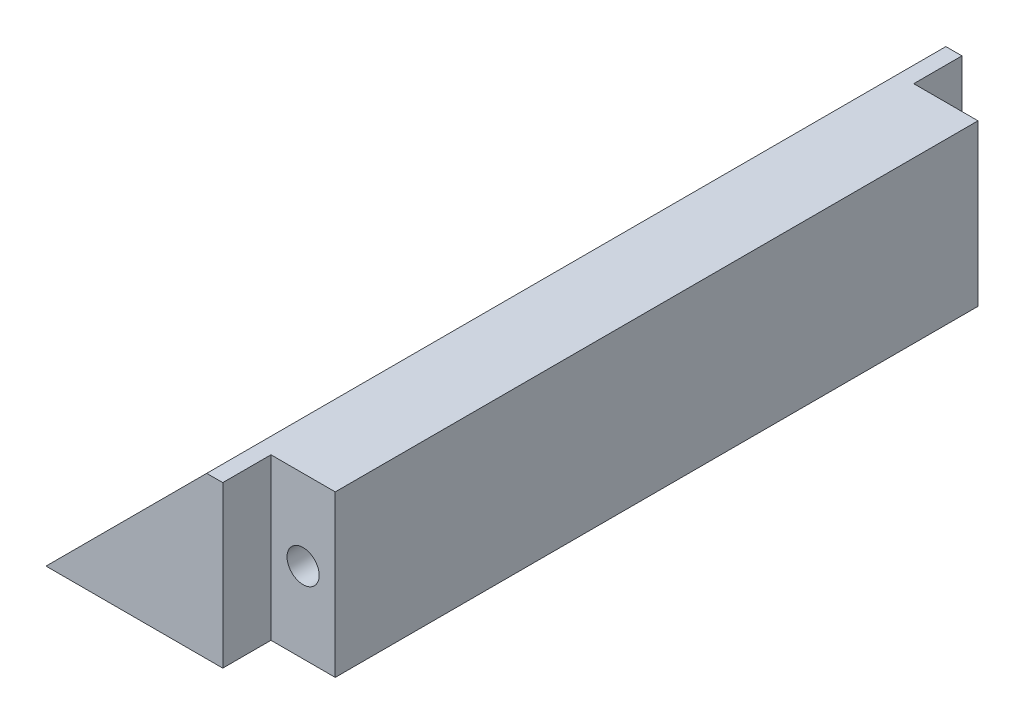
ISO-10303-21;
HEADER;
FILE_DESCRIPTION(('STEP AP214'),'2;1');
FILE_NAME('part.step','',(''),(''),'','','');
FILE_SCHEMA(('AUTOMOTIVE_DESIGN { 1 0 10303 214 1 1 1 1 }'));
ENDSEC;
DATA;
#1=APPLICATION_CONTEXT('core data for automotive mechanical design processes');
#2=APPLICATION_PROTOCOL_DEFINITION('international standard','automotive_design',2000,#1);
#3=PRODUCT_CONTEXT('',#1,'mechanical');
#4=PRODUCT('Part','Part','',(#3));
#5=PRODUCT_RELATED_PRODUCT_CATEGORY('part','',(#4));
#6=PRODUCT_DEFINITION_FORMATION('','',#4);
#7=PRODUCT_DEFINITION_CONTEXT('part definition',#1,'design');
#8=PRODUCT_DEFINITION('design','',#6,#7);
#9=PRODUCT_DEFINITION_SHAPE('','',#8);
#10=(LENGTH_UNIT() NAMED_UNIT(*) SI_UNIT(.MILLI.,.METRE.));
#11=(NAMED_UNIT(*) PLANE_ANGLE_UNIT() SI_UNIT($,.RADIAN.));
#12=(NAMED_UNIT(*) SI_UNIT($,.STERADIAN.) SOLID_ANGLE_UNIT());
#13=UNCERTAINTY_MEASURE_WITH_UNIT(LENGTH_MEASURE(1.E-05),#10,'distance_accuracy_value','');
#14=(GEOMETRIC_REPRESENTATION_CONTEXT(3) GLOBAL_UNCERTAINTY_ASSIGNED_CONTEXT((#13)) GLOBAL_UNIT_ASSIGNED_CONTEXT((#10,
#11,#12)) REPRESENTATION_CONTEXT('',''));
#15=CARTESIAN_POINT('',(0.,0.,0.));
#16=DIRECTION('',(0.,0.,1.));
#17=DIRECTION('',(1.,0.,0.));
#18=AXIS2_PLACEMENT_3D('',#15,#16,#17);
#19=CARTESIAN_POINT('',(-32.1001086054333,13.3467115606304,52.));
#20=DIRECTION('',(0.,-1.,0.));
#21=DIRECTION('',(0.,0.,-1.));
#22=AXIS2_PLACEMENT_3D('',#19,#20,#21);
#23=PLANE('',#22);
#24=DIRECTION('',(0.,0.,-1.));
#25=VECTOR('',#24,1.);
#26=CARTESIAN_POINT('',(-36.1001086054333,13.3467115606304,6.));
#27=LINE('',#26,#25);
#28=CARTESIAN_POINT('',(-36.1001086054333,13.3467115606304,6.));
#29=VERTEX_POINT('',#28);
#30=CARTESIAN_POINT('',(-36.1001086054333,13.3467115606304,3.));
#31=VERTEX_POINT('',#30);
#32=EDGE_CURVE('E136',#29,#31,#27,.T.);
#33=ORIENTED_EDGE('',*,*,#32,.T.);
#34=DIRECTION('',(1.,0.,0.));
#35=VECTOR('',#34,1.);
#36=CARTESIAN_POINT('',(-37.1001086054333,13.3467115606304,3.));
#37=LINE('',#36,#35);
#38=CARTESIAN_POINT('',(-37.1001086054333,13.3467115606304,3.));
#39=VERTEX_POINT('',#38);
#40=EDGE_CURVE('E47',#39,#31,#37,.T.);
#41=ORIENTED_EDGE('',*,*,#40,.F.);
#42=DIRECTION('',(0.,0.,-1.));
#43=VECTOR('',#42,1.);
#44=CARTESIAN_POINT('',(-37.1001086054333,13.3467115606304,52.));
#45=LINE('',#44,#43);
#46=CARTESIAN_POINT('',(-37.1001086054333,13.3467115606304,49.));
#47=VERTEX_POINT('',#46);
#48=EDGE_CURVE('E40',#47,#39,#45,.T.);
#49=ORIENTED_EDGE('',*,*,#48,.F.);
#50=DIRECTION('',(-1.,0.,0.));
#51=VECTOR('',#50,1.);
#52=CARTESIAN_POINT('',(-37.1001086054333,13.3467115606304,49.));
#53=LINE('',#52,#51);
#54=CARTESIAN_POINT('',(-36.1001086054333,13.3467115606304,49.));
#55=VERTEX_POINT('',#54);
#56=EDGE_CURVE('E153',#55,#47,#53,.T.);
#57=ORIENTED_EDGE('',*,*,#56,.F.);
#58=DIRECTION('',(0.,0.,1.));
#59=VECTOR('',#58,1.);
#60=CARTESIAN_POINT('',(-36.1001086054333,13.3467115606304,46.));
#61=LINE('',#60,#59);
#62=CARTESIAN_POINT('',(-36.1001086054333,13.3467115606304,46.));
#63=VERTEX_POINT('',#62);
#64=EDGE_CURVE('E122',#63,#55,#61,.T.);
#65=ORIENTED_EDGE('',*,*,#64,.F.);
#66=DIRECTION('',(-1.,0.,0.));
#67=VECTOR('',#66,1.);
#68=CARTESIAN_POINT('',(-32.1001086054333,13.3467115606304,46.));
#69=LINE('',#68,#67);
#70=CARTESIAN_POINT('',(-32.1001086054333,13.3467115606304,46.));
#71=VERTEX_POINT('',#70);
#72=EDGE_CURVE('E131',#71,#63,#69,.T.);
#73=ORIENTED_EDGE('',*,*,#72,.F.);
#74=DIRECTION('',(0.,0.,-1.));
#75=VECTOR('',#74,1.);
#76=CARTESIAN_POINT('',(-32.1001086054333,13.3467115606304,52.));
#77=LINE('',#76,#75);
#78=CARTESIAN_POINT('',(-32.1001086054333,13.3467115606304,6.));
#79=VERTEX_POINT('',#78);
#80=EDGE_CURVE('E11',#71,#79,#77,.T.);
#81=ORIENTED_EDGE('',*,*,#80,.T.);
#82=DIRECTION('',(1.,0.,0.));
#83=VECTOR('',#82,1.);
#84=CARTESIAN_POINT('',(-32.1001086054333,13.3467115606304,6.));
#85=LINE('',#84,#83);
#86=EDGE_CURVE('E139',#29,#79,#85,.T.);
#87=ORIENTED_EDGE('',*,*,#86,.F.);
#88=EDGE_LOOP('',(#33,#41,#49,#57,#65,#73,#81,#87));
#89=FACE_BOUND('',#88,.T.);
#90=ADVANCED_FACE('F32',(#89),#23,.F.);
#91=CARTESIAN_POINT('',(-37.1001086054333,13.3467115606304,52.));
#92=DIRECTION('',(0.707106781186549,-0.707106781186546,0.));
#93=DIRECTION('',(0.707106781186546,0.707106781186549,0.));
#94=AXIS2_PLACEMENT_3D('',#91,#92,#93);
#95=PLANE('',#94);
#96=ORIENTED_EDGE('',*,*,#48,.T.);
#97=DIRECTION('',(0.707106781186546,0.707106781186549,0.));
#98=VECTOR('',#97,1.);
#99=CARTESIAN_POINT('',(-47.1001086054332,3.34671156063036,3.));
#100=LINE('',#99,#98);
#101=CARTESIAN_POINT('',(-47.1001086054332,3.34671156063036,3.));
#102=VERTEX_POINT('',#101);
#103=EDGE_CURVE('E98',#102,#39,#100,.T.);
#104=ORIENTED_EDGE('',*,*,#103,.F.);
#105=DIRECTION('',(0.,0.,-1.));
#106=VECTOR('',#105,1.);
#107=CARTESIAN_POINT('',(-47.1001086054332,3.34671156063036,52.));
#108=LINE('',#107,#106);
#109=CARTESIAN_POINT('',(-47.1001086054332,3.34671156063036,49.));
#110=VERTEX_POINT('',#109);
#111=EDGE_CURVE('E111',#110,#102,#108,.T.);
#112=ORIENTED_EDGE('',*,*,#111,.F.);
#113=DIRECTION('',(-0.707106781186546,-0.707106781186549,0.));
#114=VECTOR('',#113,1.);
#115=CARTESIAN_POINT('',(-47.1001086054332,3.34671156063036,49.));
#116=LINE('',#115,#114);
#117=EDGE_CURVE('E151',#47,#110,#116,.T.);
#118=ORIENTED_EDGE('',*,*,#117,.F.);
#119=EDGE_LOOP('',(#96,#104,#112,#118));
#120=FACE_BOUND('',#119,.T.);
#121=ADVANCED_FACE('F109',(#120),#95,.F.);
#122=CARTESIAN_POINT('',(-32.1001086054333,3.34671156063036,52.));
#123=DIRECTION('',(0.,1.,0.));
#124=DIRECTION('',(0.,0.,1.));
#125=AXIS2_PLACEMENT_3D('',#122,#123,#124);
#126=PLANE('',#125);
#127=ORIENTED_EDGE('',*,*,#111,.T.);
#128=DIRECTION('',(-1.,0.,0.));
#129=VECTOR('',#128,1.);
#130=CARTESIAN_POINT('',(-36.1001086054333,3.34671156063036,3.));
#131=LINE('',#130,#129);
#132=CARTESIAN_POINT('',(-36.1001086054333,3.34671156063036,3.));
#133=VERTEX_POINT('',#132);
#134=EDGE_CURVE('E95',#133,#102,#131,.T.);
#135=ORIENTED_EDGE('',*,*,#134,.F.);
#136=DIRECTION('',(0.,0.,-1.));
#137=VECTOR('',#136,1.);
#138=CARTESIAN_POINT('',(-36.1001086054333,3.34671156063036,6.));
#139=LINE('',#138,#137);
#140=CARTESIAN_POINT('',(-36.1001086054333,3.34671156063036,6.));
#141=VERTEX_POINT('',#140);
#142=EDGE_CURVE('E137',#141,#133,#139,.T.);
#143=ORIENTED_EDGE('',*,*,#142,.F.);
#144=DIRECTION('',(-1.,0.,0.));
#145=VECTOR('',#144,1.);
#146=CARTESIAN_POINT('',(-32.1001086054333,3.34671156063036,6.));
#147=LINE('',#146,#145);
#148=CARTESIAN_POINT('',(-32.1001086054333,3.34671156063036,6.));
#149=VERTEX_POINT('',#148);
#150=EDGE_CURVE('E146',#149,#141,#147,.T.);
#151=ORIENTED_EDGE('',*,*,#150,.F.);
#152=DIRECTION('',(0.,0.,-1.));
#153=VECTOR('',#152,1.);
#154=CARTESIAN_POINT('',(-32.1001086054333,3.34671156063036,52.));
#155=LINE('',#154,#153);
#156=CARTESIAN_POINT('',(-32.1001086054333,3.34671156063036,46.));
#157=VERTEX_POINT('',#156);
#158=EDGE_CURVE('E116',#157,#149,#155,.T.);
#159=ORIENTED_EDGE('',*,*,#158,.F.);
#160=DIRECTION('',(1.,0.,0.));
#161=VECTOR('',#160,1.);
#162=CARTESIAN_POINT('',(-32.1001086054333,3.34671156063036,46.));
#163=LINE('',#162,#161);
#164=CARTESIAN_POINT('',(-36.1001086054333,3.34671156063035,46.));
#165=VERTEX_POINT('',#164);
#166=EDGE_CURVE('E125',#165,#157,#163,.T.);
#167=ORIENTED_EDGE('',*,*,#166,.F.);
#168=DIRECTION('',(0.,0.,1.));
#169=VECTOR('',#168,1.);
#170=CARTESIAN_POINT('',(-36.1001086054333,3.34671156063035,46.));
#171=LINE('',#170,#169);
#172=CARTESIAN_POINT('',(-36.1001086054333,3.34671156063035,49.));
#173=VERTEX_POINT('',#172);
#174=EDGE_CURVE('E119',#165,#173,#171,.T.);
#175=ORIENTED_EDGE('',*,*,#174,.T.);
#176=DIRECTION('',(1.,0.,0.));
#177=VECTOR('',#176,1.);
#178=CARTESIAN_POINT('',(-36.1001086054333,3.34671156063035,49.));
#179=LINE('',#178,#177);
#180=EDGE_CURVE('E55',#110,#173,#179,.T.);
#181=ORIENTED_EDGE('',*,*,#180,.F.);
#182=EDGE_LOOP('',(#127,#135,#143,#151,#159,#167,#175,#181));
#183=FACE_BOUND('',#182,.T.);
#184=ADVANCED_FACE('F114',(#183),#126,.F.);
#185=CARTESIAN_POINT('',(-36.1001086054333,13.3467115606304,46.));
#186=DIRECTION('',(-1.,0.,0.));
#187=DIRECTION('',(0.,0.,1.));
#188=AXIS2_PLACEMENT_3D('',#185,#186,#187);
#189=PLANE('',#188);
#190=DIRECTION('',(0.,1.,0.));
#191=VECTOR('',#190,1.);
#192=CARTESIAN_POINT('',(-36.1001086054333,13.3467115606304,49.));
#193=LINE('',#192,#191);
#194=EDGE_CURVE('E155',#173,#55,#193,.T.);
#195=ORIENTED_EDGE('',*,*,#194,.F.);
#196=ORIENTED_EDGE('',*,*,#174,.F.);
#197=DIRECTION('',(0.,-1.,0.));
#198=VECTOR('',#197,1.);
#199=CARTESIAN_POINT('',(-36.1001086054333,13.3467115606304,46.));
#200=LINE('',#199,#198);
#201=EDGE_CURVE('E128',#63,#165,#200,.T.);
#202=ORIENTED_EDGE('',*,*,#201,.F.);
#203=ORIENTED_EDGE('',*,*,#64,.T.);
#204=EDGE_LOOP('',(#195,#196,#202,#203));
#205=FACE_BOUND('',#204,.T.);
#206=ADVANCED_FACE('F202',(#205),#189,.F.);
#207=CARTESIAN_POINT('',(-32.1001086054333,3.34671156063036,52.));
#208=DIRECTION('',(-1.,0.,0.));
#209=DIRECTION('',(0.,0.,1.));
#210=AXIS2_PLACEMENT_3D('',#207,#208,#209);
#211=PLANE('',#210);
#212=DIRECTION('',(0.,-1.,0.));
#213=VECTOR('',#212,1.);
#214=CARTESIAN_POINT('',(-32.1001086054333,13.3467115606304,6.));
#215=LINE('',#214,#213);
#216=EDGE_CURVE('E149',#79,#149,#215,.T.);
#217=ORIENTED_EDGE('',*,*,#216,.F.);
#218=ORIENTED_EDGE('',*,*,#80,.F.);
#219=DIRECTION('',(0.,1.,0.));
#220=VECTOR('',#219,1.);
#221=CARTESIAN_POINT('',(-32.1001086054333,13.3467115606304,46.));
#222=LINE('',#221,#220);
#223=EDGE_CURVE('E134',#157,#71,#222,.T.);
#224=ORIENTED_EDGE('',*,*,#223,.F.);
#225=ORIENTED_EDGE('',*,*,#158,.T.);
#226=EDGE_LOOP('',(#217,#218,#224,#225));
#227=FACE_BOUND('',#226,.T.);
#228=ADVANCED_FACE('F34',(#227),#211,.F.);
#229=CARTESIAN_POINT('',(0.,0.,46.));
#230=DIRECTION('',(0.,0.,-1.));
#231=DIRECTION('',(-1.,0.,0.));
#232=AXIS2_PLACEMENT_3D('',#229,#230,#231);
#233=PLANE('',#232);
#234=CARTESIAN_POINT('',(-34.1001086054333,8.34671156063035,46.));
#235=DIRECTION('',(0.,0.,1.));
#236=DIRECTION('',(1.,0.,0.));
#237=AXIS2_PLACEMENT_3D('',#234,#235,#236);
#238=CIRCLE('',#237,0.999999999999998);
#239=CARTESIAN_POINT('',(-33.1001086054333,8.34671156063035,46.));
#240=VERTEX_POINT('',#239);
#241=EDGE_CURVE('E166',#240,#240,#238,.T.);
#242=ORIENTED_EDGE('',*,*,#241,.F.);
#243=EDGE_LOOP('',(#242));
#244=FACE_BOUND('',#243,.T.);
#245=ORIENTED_EDGE('',*,*,#223,.T.);
#246=ORIENTED_EDGE('',*,*,#72,.T.);
#247=ORIENTED_EDGE('',*,*,#201,.T.);
#248=ORIENTED_EDGE('',*,*,#166,.T.);
#249=EDGE_LOOP('',(#245,#246,#247,#248));
#250=FACE_BOUND('',#249,.T.);
#251=ADVANCED_FACE('F181',(#244,#250),#233,.F.);
#252=CARTESIAN_POINT('',(-36.1001086054333,13.3467115606304,6.));
#253=DIRECTION('',(-1.,0.,0.));
#254=DIRECTION('',(0.,0.,1.));
#255=AXIS2_PLACEMENT_3D('',#252,#253,#254);
#256=PLANE('',#255);
#257=ORIENTED_EDGE('',*,*,#142,.T.);
#258=DIRECTION('',(0.,-1.,0.));
#259=VECTOR('',#258,1.);
#260=CARTESIAN_POINT('',(-36.1001086054333,13.3467115606304,3.));
#261=LINE('',#260,#259);
#262=EDGE_CURVE('E99',#31,#133,#261,.T.);
#263=ORIENTED_EDGE('',*,*,#262,.F.);
#264=ORIENTED_EDGE('',*,*,#32,.F.);
#265=DIRECTION('',(0.,1.,0.));
#266=VECTOR('',#265,1.);
#267=CARTESIAN_POINT('',(-36.1001086054333,13.3467115606304,6.));
#268=LINE('',#267,#266);
#269=EDGE_CURVE('E143',#141,#29,#268,.T.);
#270=ORIENTED_EDGE('',*,*,#269,.F.);
#271=EDGE_LOOP('',(#257,#263,#264,#270));
#272=FACE_BOUND('',#271,.T.);
#273=ADVANCED_FACE('F184',(#272),#256,.F.);
#274=CARTESIAN_POINT('',(0.,0.,6.));
#275=DIRECTION('',(0.,0.,-1.));
#276=DIRECTION('',(-1.,0.,0.));
#277=AXIS2_PLACEMENT_3D('',#274,#275,#276);
#278=PLANE('',#277);
#279=CARTESIAN_POINT('',(-34.1001086054333,8.34671156063035,6.));
#280=DIRECTION('',(0.,0.,-1.));
#281=DIRECTION('',(-1.,0.,0.));
#282=AXIS2_PLACEMENT_3D('',#279,#280,#281);
#283=CIRCLE('',#282,0.999999999999998);
#284=CARTESIAN_POINT('',(-35.1001086054333,8.34671156063035,6.));
#285=VERTEX_POINT('',#284);
#286=EDGE_CURVE('E160',#285,#285,#283,.T.);
#287=ORIENTED_EDGE('',*,*,#286,.F.);
#288=EDGE_LOOP('',(#287));
#289=FACE_BOUND('',#288,.T.);
#290=ORIENTED_EDGE('',*,*,#216,.T.);
#291=ORIENTED_EDGE('',*,*,#150,.T.);
#292=ORIENTED_EDGE('',*,*,#269,.T.);
#293=ORIENTED_EDGE('',*,*,#86,.T.);
#294=EDGE_LOOP('',(#290,#291,#292,#293));
#295=FACE_BOUND('',#294,.T.);
#296=ADVANCED_FACE('F199',(#289,#295),#278,.T.);
#297=CARTESIAN_POINT('',(0.,0.,49.));
#298=DIRECTION('',(0.,0.,1.));
#299=DIRECTION('',(1.,0.,0.));
#300=AXIS2_PLACEMENT_3D('',#297,#298,#299);
#301=PLANE('',#300);
#302=ORIENTED_EDGE('',*,*,#180,.T.);
#303=ORIENTED_EDGE('',*,*,#194,.T.);
#304=ORIENTED_EDGE('',*,*,#56,.T.);
#305=ORIENTED_EDGE('',*,*,#117,.T.);
#306=EDGE_LOOP('',(#302,#303,#304,#305));
#307=FACE_BOUND('',#306,.T.);
#308=ADVANCED_FACE('F203',(#307),#301,.T.);
#309=CARTESIAN_POINT('',(0.,0.,3.));
#310=DIRECTION('',(0.,0.,1.));
#311=DIRECTION('',(1.,0.,0.));
#312=AXIS2_PLACEMENT_3D('',#309,#310,#311);
#313=PLANE('',#312);
#314=ORIENTED_EDGE('',*,*,#134,.T.);
#315=ORIENTED_EDGE('',*,*,#103,.T.);
#316=ORIENTED_EDGE('',*,*,#40,.T.);
#317=ORIENTED_EDGE('',*,*,#262,.T.);
#318=EDGE_LOOP('',(#314,#315,#316,#317));
#319=FACE_BOUND('',#318,.T.);
#320=ADVANCED_FACE('F97',(#319),#313,.F.);
#321=CARTESIAN_POINT('',(-34.1001086054333,8.34671156063035,16.));
#322=DIRECTION('',(0.,0.,-1.));
#323=DIRECTION('',(-1.,0.,0.));
#324=AXIS2_PLACEMENT_3D('',#321,#322,#323);
#325=CYLINDRICAL_SURFACE('',#324,0.999999999999998);
#326=CARTESIAN_POINT('',(-34.1001086054333,8.34671156063035,16.));
#327=DIRECTION('',(0.,0.,-1.));
#328=DIRECTION('',(-1.,0.,0.));
#329=AXIS2_PLACEMENT_3D('',#326,#327,#328);
#330=CIRCLE('',#329,0.999999999999998);
#331=CARTESIAN_POINT('',(-35.1001086054333,8.34671156063035,16.));
#332=VERTEX_POINT('',#331);
#333=EDGE_CURVE('E104',#332,#332,#330,.T.);
#334=ORIENTED_EDGE('',*,*,#333,.F.);
#335=EDGE_LOOP('',(#334));
#336=FACE_BOUND('',#335,.T.);
#337=ORIENTED_EDGE('',*,*,#286,.T.);
#338=EDGE_LOOP('',(#337));
#339=FACE_BOUND('',#338,.T.);
#340=ADVANCED_FACE('F210',(#336,#339),#325,.F.);
#341=CARTESIAN_POINT('',(-34.1001086054333,8.34671156063035,16.));
#342=DIRECTION('',(0.,0.,-1.));
#343=DIRECTION('',(-1.,0.,0.));
#344=AXIS2_PLACEMENT_3D('',#341,#342,#343);
#345=PLANE('',#344);
#346=ORIENTED_EDGE('',*,*,#333,.T.);
#347=EDGE_LOOP('',(#346));
#348=FACE_BOUND('',#347,.T.);
#349=ADVANCED_FACE('F177',(#348),#345,.T.);
#350=CARTESIAN_POINT('',(-34.1001086054333,8.34671156063035,36.));
#351=DIRECTION('',(0.,0.,1.));
#352=DIRECTION('',(1.,0.,0.));
#353=AXIS2_PLACEMENT_3D('',#350,#351,#352);
#354=CYLINDRICAL_SURFACE('',#353,0.999999999999998);
#355=CARTESIAN_POINT('',(-34.1001086054333,8.34671156063035,36.));
#356=DIRECTION('',(0.,0.,1.));
#357=DIRECTION('',(1.,0.,0.));
#358=AXIS2_PLACEMENT_3D('',#355,#356,#357);
#359=CIRCLE('',#358,0.999999999999998);
#360=CARTESIAN_POINT('',(-33.1001086054333,8.34671156063035,36.));
#361=VERTEX_POINT('',#360);
#362=EDGE_CURVE('E163',#361,#361,#359,.T.);
#363=ORIENTED_EDGE('',*,*,#362,.F.);
#364=EDGE_LOOP('',(#363));
#365=FACE_BOUND('',#364,.T.);
#366=ORIENTED_EDGE('',*,*,#241,.T.);
#367=EDGE_LOOP('',(#366));
#368=FACE_BOUND('',#367,.T.);
#369=ADVANCED_FACE('F174',(#365,#368),#354,.F.);
#370=CARTESIAN_POINT('',(-34.1001086054333,8.34671156063035,36.));
#371=DIRECTION('',(0.,0.,1.));
#372=DIRECTION('',(1.,0.,0.));
#373=AXIS2_PLACEMENT_3D('',#370,#371,#372);
#374=PLANE('',#373);
#375=ORIENTED_EDGE('',*,*,#362,.T.);
#376=EDGE_LOOP('',(#375));
#377=FACE_BOUND('',#376,.T.);
#378=ADVANCED_FACE('F172',(#377),#374,.T.);
#379=CLOSED_SHELL('',(#90,#121,#184,#206,#228,#251,#273,#296,#308,#320,#340,#349,#369,#378));
#380=MANIFOLD_SOLID_BREP('B2',#379);
#381=ADVANCED_BREP_SHAPE_REPRESENTATION('',(#18,#380),#14);
#382=SHAPE_DEFINITION_REPRESENTATION(#9,#381);
ENDSEC;
END-ISO-10303-21;
